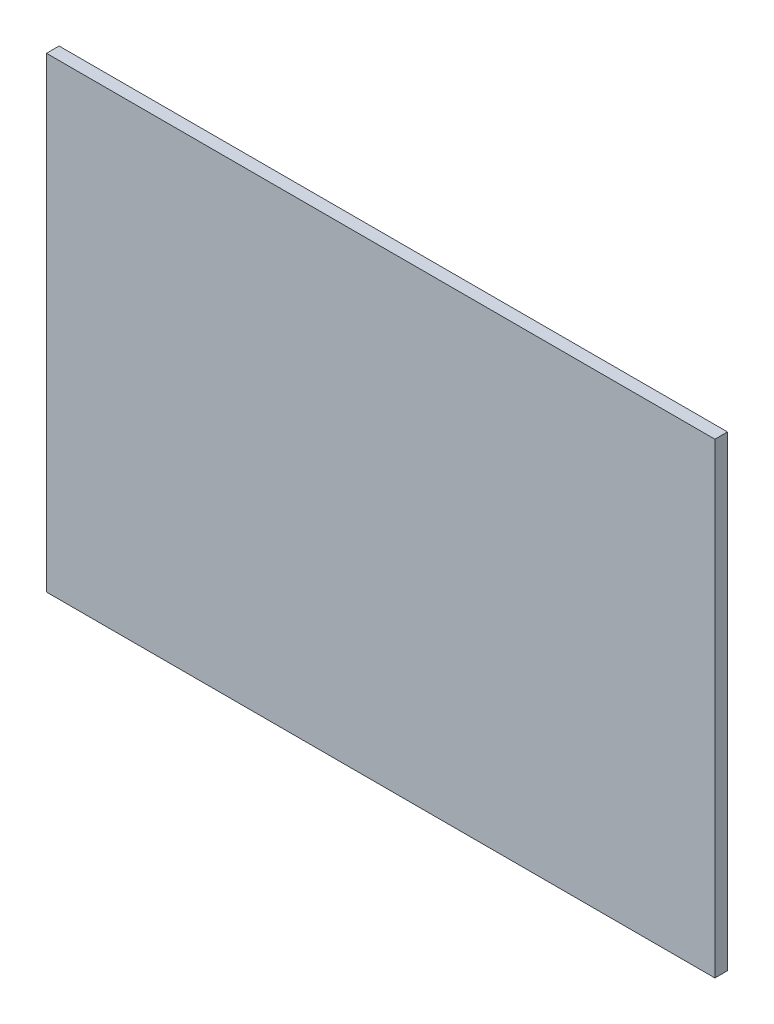
ISO-10303-21;
HEADER;
FILE_DESCRIPTION(('STEP AP214'),'2;1');
FILE_NAME('part.step','',(''),(''),'','','');
FILE_SCHEMA(('AUTOMOTIVE_DESIGN { 1 0 10303 214 1 1 1 1 }'));
ENDSEC;
DATA;
#1=APPLICATION_CONTEXT('core data for automotive mechanical design processes');
#2=APPLICATION_PROTOCOL_DEFINITION('international standard','automotive_design',2000,#1);
#3=PRODUCT_CONTEXT('',#1,'mechanical');
#4=PRODUCT('Part','Part','',(#3));
#5=PRODUCT_RELATED_PRODUCT_CATEGORY('part','',(#4));
#6=PRODUCT_DEFINITION_FORMATION('','',#4);
#7=PRODUCT_DEFINITION_CONTEXT('part definition',#1,'design');
#8=PRODUCT_DEFINITION('design','',#6,#7);
#9=PRODUCT_DEFINITION_SHAPE('','',#8);
#10=(LENGTH_UNIT() NAMED_UNIT(*) SI_UNIT(.MILLI.,.METRE.));
#11=(NAMED_UNIT(*) PLANE_ANGLE_UNIT() SI_UNIT($,.RADIAN.));
#12=(NAMED_UNIT(*) SI_UNIT($,.STERADIAN.) SOLID_ANGLE_UNIT());
#13=UNCERTAINTY_MEASURE_WITH_UNIT(LENGTH_MEASURE(1.E-05),#10,'distance_accuracy_value','');
#14=(GEOMETRIC_REPRESENTATION_CONTEXT(3) GLOBAL_UNCERTAINTY_ASSIGNED_CONTEXT((#13)) GLOBAL_UNIT_ASSIGNED_CONTEXT((#10,
#11,#12)) REPRESENTATION_CONTEXT('',''));
#15=CARTESIAN_POINT('',(0.,0.,0.));
#16=DIRECTION('',(0.,0.,1.));
#17=DIRECTION('',(1.,0.,0.));
#18=AXIS2_PLACEMENT_3D('',#15,#16,#17);
#19=CARTESIAN_POINT('',(265.,-185.,10.));
#20=DIRECTION('',(-1.,0.,0.));
#21=DIRECTION('',(0.,0.,1.));
#22=AXIS2_PLACEMENT_3D('',#19,#20,#21);
#23=PLANE('',#22);
#24=DIRECTION('',(0.,1.,0.));
#25=VECTOR('',#24,1.);
#26=CARTESIAN_POINT('',(265.,-185.,0.));
#27=LINE('',#26,#25);
#28=CARTESIAN_POINT('',(265.,-185.,0.));
#29=VERTEX_POINT('',#28);
#30=CARTESIAN_POINT('',(265.,185.,0.));
#31=VERTEX_POINT('',#30);
#32=EDGE_CURVE('E96',#29,#31,#27,.T.);
#33=ORIENTED_EDGE('',*,*,#32,.T.);
#34=DIRECTION('',(0.,0.,-1.));
#35=VECTOR('',#34,1.);
#36=CARTESIAN_POINT('',(265.,185.,10.));
#37=LINE('',#36,#35);
#38=CARTESIAN_POINT('',(265.,185.,10.));
#39=VERTEX_POINT('',#38);
#40=EDGE_CURVE('E11',#39,#31,#37,.T.);
#41=ORIENTED_EDGE('',*,*,#40,.F.);
#42=DIRECTION('',(0.,1.,0.));
#43=VECTOR('',#42,1.);
#44=CARTESIAN_POINT('',(265.,-185.,10.));
#45=LINE('',#44,#43);
#46=CARTESIAN_POINT('',(265.,-185.,10.));
#47=VERTEX_POINT('',#46);
#48=EDGE_CURVE('E84',#47,#39,#45,.T.);
#49=ORIENTED_EDGE('',*,*,#48,.F.);
#50=DIRECTION('',(0.,0.,-1.));
#51=VECTOR('',#50,1.);
#52=CARTESIAN_POINT('',(265.,-185.,10.));
#53=LINE('',#52,#51);
#54=EDGE_CURVE('E92',#47,#29,#53,.T.);
#55=ORIENTED_EDGE('',*,*,#54,.T.);
#56=EDGE_LOOP('',(#33,#41,#49,#55));
#57=FACE_BOUND('',#56,.T.);
#58=ADVANCED_FACE('F33',(#57),#23,.F.);
#59=CARTESIAN_POINT('',(-265.,185.,10.));
#60=DIRECTION('',(0.,-1.,0.));
#61=DIRECTION('',(0.,0.,-1.));
#62=AXIS2_PLACEMENT_3D('',#59,#60,#61);
#63=PLANE('',#62);
#64=DIRECTION('',(-1.,0.,0.));
#65=VECTOR('',#64,1.);
#66=CARTESIAN_POINT('',(-265.,185.,0.));
#67=LINE('',#66,#65);
#68=CARTESIAN_POINT('',(-265.,185.,0.));
#69=VERTEX_POINT('',#68);
#70=EDGE_CURVE('E88',#31,#69,#67,.T.);
#71=ORIENTED_EDGE('',*,*,#70,.T.);
#72=DIRECTION('',(0.,0.,-1.));
#73=VECTOR('',#72,1.);
#74=CARTESIAN_POINT('',(-265.,185.,10.));
#75=LINE('',#74,#73);
#76=CARTESIAN_POINT('',(-265.,185.,10.));
#77=VERTEX_POINT('',#76);
#78=EDGE_CURVE('E41',#77,#69,#75,.T.);
#79=ORIENTED_EDGE('',*,*,#78,.F.);
#80=DIRECTION('',(-1.,0.,0.));
#81=VECTOR('',#80,1.);
#82=CARTESIAN_POINT('',(-265.,185.,10.));
#83=LINE('',#82,#81);
#84=EDGE_CURVE('E79',#39,#77,#83,.T.);
#85=ORIENTED_EDGE('',*,*,#84,.F.);
#86=ORIENTED_EDGE('',*,*,#40,.T.);
#87=EDGE_LOOP('',(#71,#79,#85,#86));
#88=FACE_BOUND('',#87,.T.);
#89=ADVANCED_FACE('F87',(#88),#63,.F.);
#90=CARTESIAN_POINT('',(-265.,-185.,10.));
#91=DIRECTION('',(1.,0.,0.));
#92=DIRECTION('',(0.,0.,-1.));
#93=AXIS2_PLACEMENT_3D('',#90,#91,#92);
#94=PLANE('',#93);
#95=DIRECTION('',(0.,-1.,0.));
#96=VECTOR('',#95,1.);
#97=CARTESIAN_POINT('',(-265.,-185.,0.));
#98=LINE('',#97,#96);
#99=CARTESIAN_POINT('',(-265.,-185.,0.));
#100=VERTEX_POINT('',#99);
#101=EDGE_CURVE('E66',#69,#100,#98,.T.);
#102=ORIENTED_EDGE('',*,*,#101,.T.);
#103=DIRECTION('',(0.,0.,-1.));
#104=VECTOR('',#103,1.);
#105=CARTESIAN_POINT('',(-265.,-185.,10.));
#106=LINE('',#105,#104);
#107=CARTESIAN_POINT('',(-265.,-185.,10.));
#108=VERTEX_POINT('',#107);
#109=EDGE_CURVE('E89',#108,#100,#106,.T.);
#110=ORIENTED_EDGE('',*,*,#109,.F.);
#111=DIRECTION('',(0.,-1.,0.));
#112=VECTOR('',#111,1.);
#113=CARTESIAN_POINT('',(-265.,-185.,10.));
#114=LINE('',#113,#112);
#115=EDGE_CURVE('E82',#77,#108,#114,.T.);
#116=ORIENTED_EDGE('',*,*,#115,.F.);
#117=ORIENTED_EDGE('',*,*,#78,.T.);
#118=EDGE_LOOP('',(#102,#110,#116,#117));
#119=FACE_BOUND('',#118,.T.);
#120=ADVANCED_FACE('F90',(#119),#94,.F.);
#121=CARTESIAN_POINT('',(-265.,-185.,10.));
#122=DIRECTION('',(0.,1.,0.));
#123=DIRECTION('',(0.,0.,1.));
#124=AXIS2_PLACEMENT_3D('',#121,#122,#123);
#125=PLANE('',#124);
#126=DIRECTION('',(1.,0.,0.));
#127=VECTOR('',#126,1.);
#128=CARTESIAN_POINT('',(-265.,-185.,0.));
#129=LINE('',#128,#127);
#130=EDGE_CURVE('E72',#100,#29,#129,.T.);
#131=ORIENTED_EDGE('',*,*,#130,.T.);
#132=ORIENTED_EDGE('',*,*,#54,.F.);
#133=DIRECTION('',(1.,0.,0.));
#134=VECTOR('',#133,1.);
#135=CARTESIAN_POINT('',(-265.,-185.,10.));
#136=LINE('',#135,#134);
#137=EDGE_CURVE('E49',#108,#47,#136,.T.);
#138=ORIENTED_EDGE('',*,*,#137,.F.);
#139=ORIENTED_EDGE('',*,*,#109,.T.);
#140=EDGE_LOOP('',(#131,#132,#138,#139));
#141=FACE_BOUND('',#140,.T.);
#142=ADVANCED_FACE('F103',(#141),#125,.F.);
#143=CARTESIAN_POINT('',(0.,0.,10.));
#144=DIRECTION('',(0.,0.,-1.));
#145=DIRECTION('',(-1.,0.,0.));
#146=AXIS2_PLACEMENT_3D('',#143,#144,#145);
#147=PLANE('',#146);
#148=ORIENTED_EDGE('',*,*,#48,.T.);
#149=ORIENTED_EDGE('',*,*,#84,.T.);
#150=ORIENTED_EDGE('',*,*,#115,.T.);
#151=ORIENTED_EDGE('',*,*,#137,.T.);
#152=EDGE_LOOP('',(#148,#149,#150,#151));
#153=FACE_BOUND('',#152,.T.);
#154=ADVANCED_FACE('F80',(#153),#147,.F.);
#155=CARTESIAN_POINT('',(0.,0.,0.));
#156=DIRECTION('',(0.,0.,-1.));
#157=DIRECTION('',(-1.,0.,0.));
#158=AXIS2_PLACEMENT_3D('',#155,#156,#157);
#159=PLANE('',#158);
#160=ORIENTED_EDGE('',*,*,#32,.F.);
#161=ORIENTED_EDGE('',*,*,#130,.F.);
#162=ORIENTED_EDGE('',*,*,#101,.F.);
#163=ORIENTED_EDGE('',*,*,#70,.F.);
#164=EDGE_LOOP('',(#160,#161,#162,#163));
#165=FACE_BOUND('',#164,.T.);
#166=ADVANCED_FACE('F106',(#165),#159,.T.);
#167=CLOSED_SHELL('',(#58,#89,#120,#142,#154,#166));
#168=MANIFOLD_SOLID_BREP('B2',#167);
#169=ADVANCED_BREP_SHAPE_REPRESENTATION('',(#18,#168),#14);
#170=SHAPE_DEFINITION_REPRESENTATION(#9,#169);
ENDSEC;
END-ISO-10303-21;
